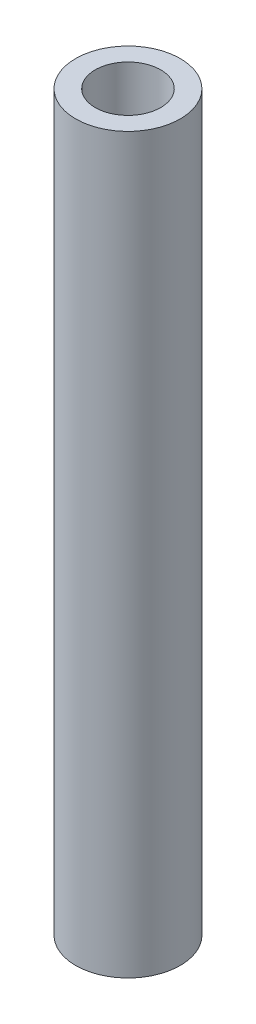
ISO-10303-21;
HEADER;
FILE_DESCRIPTION(('STEP AP214'),'2;1');
FILE_NAME('part.step','',(''),(''),'','','');
FILE_SCHEMA(('AUTOMOTIVE_DESIGN { 1 0 10303 214 1 1 1 1 }'));
ENDSEC;
DATA;
#1=APPLICATION_CONTEXT('core data for automotive mechanical design processes');
#2=APPLICATION_PROTOCOL_DEFINITION('international standard','automotive_design',2000,#1);
#3=PRODUCT_CONTEXT('',#1,'mechanical');
#4=PRODUCT('Part','Part','',(#3));
#5=PRODUCT_RELATED_PRODUCT_CATEGORY('part','',(#4));
#6=PRODUCT_DEFINITION_FORMATION('','',#4);
#7=PRODUCT_DEFINITION_CONTEXT('part definition',#1,'design');
#8=PRODUCT_DEFINITION('design','',#6,#7);
#9=PRODUCT_DEFINITION_SHAPE('','',#8);
#10=(LENGTH_UNIT() NAMED_UNIT(*) SI_UNIT(.MILLI.,.METRE.));
#11=(NAMED_UNIT(*) PLANE_ANGLE_UNIT() SI_UNIT($,.RADIAN.));
#12=(NAMED_UNIT(*) SI_UNIT($,.STERADIAN.) SOLID_ANGLE_UNIT());
#13=UNCERTAINTY_MEASURE_WITH_UNIT(LENGTH_MEASURE(1.E-05),#10,'distance_accuracy_value','');
#14=(GEOMETRIC_REPRESENTATION_CONTEXT(3) GLOBAL_UNCERTAINTY_ASSIGNED_CONTEXT((#13)) GLOBAL_UNIT_ASSIGNED_CONTEXT((#10,
#11,#12)) REPRESENTATION_CONTEXT('',''));
#15=CARTESIAN_POINT('',(0.,0.,0.));
#16=DIRECTION('',(0.,0.,1.));
#17=DIRECTION('',(1.,0.,0.));
#18=AXIS2_PLACEMENT_3D('',#15,#16,#17);
#19=CARTESIAN_POINT('',(0.,55.7276,0.));
#20=DIRECTION('',(0.,1.,0.));
#21=DIRECTION('',(0.,0.,1.));
#22=AXIS2_PLACEMENT_3D('',#19,#20,#21);
#23=PLANE('',#22);
#24=CARTESIAN_POINT('',(0.,55.7276,0.));
#25=DIRECTION('',(0.,1.,0.));
#26=DIRECTION('',(0.,0.,1.));
#27=AXIS2_PLACEMENT_3D('',#24,#25,#26);
#28=CIRCLE('',#27,3.9751);
#29=CARTESIAN_POINT('',(0.,55.7276,3.9751));
#30=VERTEX_POINT('',#29);
#31=EDGE_CURVE('E10',#30,#30,#28,.T.);
#32=ORIENTED_EDGE('',*,*,#31,.T.);
#33=EDGE_LOOP('',(#32));
#34=FACE_BOUND('',#33,.T.);
#35=CARTESIAN_POINT('',(0.,55.7276,0.));
#36=DIRECTION('',(0.,1.,0.));
#37=DIRECTION('',(0.,0.,1.));
#38=AXIS2_PLACEMENT_3D('',#35,#36,#37);
#39=CIRCLE('',#38,2.4892);
#40=CARTESIAN_POINT('',(0.,55.7276,2.4892));
#41=VERTEX_POINT('',#40);
#42=EDGE_CURVE('E42',#41,#41,#39,.T.);
#43=ORIENTED_EDGE('',*,*,#42,.F.);
#44=EDGE_LOOP('',(#43));
#45=FACE_BOUND('',#44,.T.);
#46=ADVANCED_FACE('F31',(#34,#45),#23,.T.);
#47=CARTESIAN_POINT('',(0.,0.,0.));
#48=DIRECTION('',(0.,1.,0.));
#49=DIRECTION('',(0.,0.,1.));
#50=AXIS2_PLACEMENT_3D('',#47,#48,#49);
#51=PLANE('',#50);
#52=CARTESIAN_POINT('',(0.,0.,0.));
#53=DIRECTION('',(0.,1.,0.));
#54=DIRECTION('',(0.,0.,1.));
#55=AXIS2_PLACEMENT_3D('',#52,#53,#54);
#56=CIRCLE('',#55,3.9751);
#57=CARTESIAN_POINT('',(0.,0.,3.9751));
#58=VERTEX_POINT('',#57);
#59=EDGE_CURVE('E35',#58,#58,#56,.T.);
#60=ORIENTED_EDGE('',*,*,#59,.F.);
#61=EDGE_LOOP('',(#60));
#62=FACE_BOUND('',#61,.T.);
#63=CARTESIAN_POINT('',(0.,0.,0.));
#64=DIRECTION('',(0.,1.,0.));
#65=DIRECTION('',(0.,0.,1.));
#66=AXIS2_PLACEMENT_3D('',#63,#64,#65);
#67=CIRCLE('',#66,2.4892);
#68=CARTESIAN_POINT('',(0.,0.,2.4892));
#69=VERTEX_POINT('',#68);
#70=EDGE_CURVE('E44',#69,#69,#67,.T.);
#71=ORIENTED_EDGE('',*,*,#70,.T.);
#72=EDGE_LOOP('',(#71));
#73=FACE_BOUND('',#72,.T.);
#74=ADVANCED_FACE('F54',(#62,#73),#51,.F.);
#75=CARTESIAN_POINT('',(0.,55.7276,0.));
#76=DIRECTION('',(0.,-1.,0.));
#77=DIRECTION('',(0.,0.,-1.));
#78=AXIS2_PLACEMENT_3D('',#75,#76,#77);
#79=CYLINDRICAL_SURFACE('',#78,3.9751);
#80=ORIENTED_EDGE('',*,*,#31,.F.);
#81=EDGE_LOOP('',(#80));
#82=FACE_BOUND('',#81,.T.);
#83=ORIENTED_EDGE('',*,*,#59,.T.);
#84=EDGE_LOOP('',(#83));
#85=FACE_BOUND('',#84,.T.);
#86=ADVANCED_FACE('F33',(#82,#85),#79,.T.);
#87=CARTESIAN_POINT('',(0.,55.7276,0.));
#88=DIRECTION('',(0.,-1.,0.));
#89=DIRECTION('',(0.,0.,-1.));
#90=AXIS2_PLACEMENT_3D('',#87,#88,#89);
#91=CYLINDRICAL_SURFACE('',#90,2.4892);
#92=ORIENTED_EDGE('',*,*,#42,.T.);
#93=EDGE_LOOP('',(#92));
#94=FACE_BOUND('',#93,.T.);
#95=ORIENTED_EDGE('',*,*,#70,.F.);
#96=EDGE_LOOP('',(#95));
#97=FACE_BOUND('',#96,.T.);
#98=ADVANCED_FACE('F50',(#94,#97),#91,.F.);
#99=CLOSED_SHELL('',(#46,#74,#86,#98));
#100=MANIFOLD_SOLID_BREP('B2',#99);
#101=ADVANCED_BREP_SHAPE_REPRESENTATION('',(#18,#100),#14);
#102=SHAPE_DEFINITION_REPRESENTATION(#9,#101);
ENDSEC;
END-ISO-10303-21;
